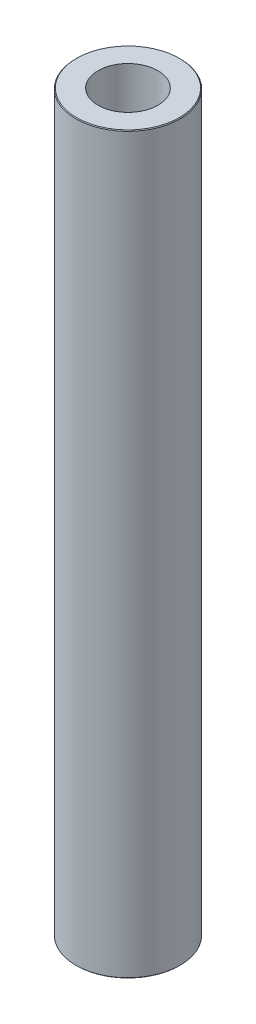
ISO-10303-21;
HEADER;
FILE_DESCRIPTION(('STEP AP214'),'2;1');
FILE_NAME('part.step','',(''),(''),'','','');
FILE_SCHEMA(('AUTOMOTIVE_DESIGN { 1 0 10303 214 1 1 1 1 }'));
ENDSEC;
DATA;
#1=APPLICATION_CONTEXT('core data for automotive mechanical design processes');
#2=APPLICATION_PROTOCOL_DEFINITION('international standard','automotive_design',2000,#1);
#3=PRODUCT_CONTEXT('',#1,'mechanical');
#4=PRODUCT('Part','Part','',(#3));
#5=PRODUCT_RELATED_PRODUCT_CATEGORY('part','',(#4));
#6=PRODUCT_DEFINITION_FORMATION('','',#4);
#7=PRODUCT_DEFINITION_CONTEXT('part definition',#1,'design');
#8=PRODUCT_DEFINITION('design','',#6,#7);
#9=PRODUCT_DEFINITION_SHAPE('','',#8);
#10=(LENGTH_UNIT() NAMED_UNIT(*) SI_UNIT(.MILLI.,.METRE.));
#11=(NAMED_UNIT(*) PLANE_ANGLE_UNIT() SI_UNIT($,.RADIAN.));
#12=(NAMED_UNIT(*) SI_UNIT($,.STERADIAN.) SOLID_ANGLE_UNIT());
#13=UNCERTAINTY_MEASURE_WITH_UNIT(LENGTH_MEASURE(1.E-05),#10,'distance_accuracy_value','');
#14=(GEOMETRIC_REPRESENTATION_CONTEXT(3) GLOBAL_UNCERTAINTY_ASSIGNED_CONTEXT((#13)) GLOBAL_UNIT_ASSIGNED_CONTEXT((#10,
#11,#12)) REPRESENTATION_CONTEXT('',''));
#15=CARTESIAN_POINT('',(0.,0.,0.));
#16=DIRECTION('',(0.,0.,1.));
#17=DIRECTION('',(1.,0.,0.));
#18=AXIS2_PLACEMENT_3D('',#15,#16,#17);
#19=CARTESIAN_POINT('',(0.,493.163189731923,0.));
#20=DIRECTION('',(0.,-1.,0.));
#21=DIRECTION('',(0.,0.,-1.));
#22=AXIS2_PLACEMENT_3D('',#19,#20,#21);
#23=CYLINDRICAL_SURFACE('',#22,35.);
#24=CARTESIAN_POINT('',(0.,492.677276126672,0.));
#25=DIRECTION('',(0.,1.,0.));
#26=DIRECTION('',(0.,0.,1.));
#27=AXIS2_PLACEMENT_3D('',#24,#25,#26);
#28=CIRCLE('',#27,35.);
#29=CARTESIAN_POINT('',(0.,492.677276126672,35.));
#30=VERTEX_POINT('',#29);
#31=EDGE_CURVE('E50',#30,#30,#28,.F.);
#32=ORIENTED_EDGE('',*,*,#31,.T.);
#33=EDGE_LOOP('',(#32));
#34=FACE_BOUND('',#33,.T.);
#35=CARTESIAN_POINT('',(0.,0.485913605251298,0.));
#36=DIRECTION('',(0.,1.,0.));
#37=DIRECTION('',(0.,0.,1.));
#38=AXIS2_PLACEMENT_3D('',#35,#36,#37);
#39=CIRCLE('',#38,35.);
#40=CARTESIAN_POINT('',(0.,0.485913605251298,35.));
#41=VERTEX_POINT('',#40);
#42=EDGE_CURVE('E51',#41,#41,#39,.T.);
#43=ORIENTED_EDGE('',*,*,#42,.T.);
#44=EDGE_LOOP('',(#43));
#45=FACE_BOUND('',#44,.T.);
#46=ADVANCED_FACE('F39',(#34,#45),#23,.T.);
#47=CARTESIAN_POINT('',(0.,493.163189731923,0.));
#48=DIRECTION('',(0.,1.,0.));
#49=DIRECTION('',(0.,0.,1.));
#50=AXIS2_PLACEMENT_3D('',#47,#48,#49);
#51=PLANE('',#50);
#52=CARTESIAN_POINT('',(0.,493.163189731923,0.));
#53=DIRECTION('',(0.,1.,0.));
#54=DIRECTION('',(0.,0.,1.));
#55=AXIS2_PLACEMENT_3D('',#52,#53,#54);
#56=CIRCLE('',#55,34.5140863947485);
#57=CARTESIAN_POINT('',(0.,493.163189731923,34.5140863947485));
#58=VERTEX_POINT('',#57);
#59=EDGE_CURVE('E54',#58,#58,#56,.T.);
#60=ORIENTED_EDGE('',*,*,#59,.T.);
#61=EDGE_LOOP('',(#60));
#62=FACE_BOUND('',#61,.T.);
#63=CARTESIAN_POINT('',(0.,493.163189731923,0.));
#64=DIRECTION('',(0.,1.,0.));
#65=DIRECTION('',(0.,0.,1.));
#66=AXIS2_PLACEMENT_3D('',#63,#64,#65);
#67=CIRCLE('',#66,20.119308325277);
#68=CARTESIAN_POINT('',(0.,493.163189731923,20.119308325277));
#69=VERTEX_POINT('',#68);
#70=EDGE_CURVE('E58',#69,#69,#67,.T.);
#71=ORIENTED_EDGE('',*,*,#70,.F.);
#72=EDGE_LOOP('',(#71));
#73=FACE_BOUND('',#72,.T.);
#74=ADVANCED_FACE('F69',(#62,#73),#51,.T.);
#75=CARTESIAN_POINT('',(0.,0.,0.));
#76=DIRECTION('',(0.,1.,0.));
#77=DIRECTION('',(0.,0.,1.));
#78=AXIS2_PLACEMENT_3D('',#75,#76,#77);
#79=PLANE('',#78);
#80=CARTESIAN_POINT('',(0.,0.,0.));
#81=DIRECTION('',(0.,1.,0.));
#82=DIRECTION('',(0.,0.,1.));
#83=AXIS2_PLACEMENT_3D('',#80,#81,#82);
#84=CIRCLE('',#83,34.5140863947487);
#85=CARTESIAN_POINT('',(0.,0.,34.5140863947487));
#86=VERTEX_POINT('',#85);
#87=EDGE_CURVE('E10',#86,#86,#84,.F.);
#88=ORIENTED_EDGE('',*,*,#87,.T.);
#89=EDGE_LOOP('',(#88));
#90=FACE_BOUND('',#89,.T.);
#91=CARTESIAN_POINT('',(0.,0.,0.));
#92=DIRECTION('',(0.,1.,0.));
#93=DIRECTION('',(0.,0.,1.));
#94=AXIS2_PLACEMENT_3D('',#91,#92,#93);
#95=CIRCLE('',#94,20.119308325277);
#96=CARTESIAN_POINT('',(0.,0.,20.119308325277));
#97=VERTEX_POINT('',#96);
#98=EDGE_CURVE('E63',#97,#97,#95,.T.);
#99=ORIENTED_EDGE('',*,*,#98,.T.);
#100=EDGE_LOOP('',(#99));
#101=FACE_BOUND('',#100,.T.);
#102=ADVANCED_FACE('F75',(#90,#101),#79,.F.);
#103=CARTESIAN_POINT('',(0.,493.163189731923,0.));
#104=DIRECTION('',(0.,-1.,0.));
#105=DIRECTION('',(0.,0.,-1.));
#106=AXIS2_PLACEMENT_3D('',#103,#104,#105);
#107=CYLINDRICAL_SURFACE('',#106,20.119308325277);
#108=ORIENTED_EDGE('',*,*,#70,.T.);
#109=EDGE_LOOP('',(#108));
#110=FACE_BOUND('',#109,.T.);
#111=ORIENTED_EDGE('',*,*,#98,.F.);
#112=EDGE_LOOP('',(#111));
#113=FACE_BOUND('',#112,.T.);
#114=ADVANCED_FACE('F70',(#110,#113),#107,.F.);
#115=CARTESIAN_POINT('',(0.,493.163189731923,0.));
#116=DIRECTION('',(0.,-1.,0.));
#117=DIRECTION('',(0.,0.,-1.));
#118=AXIS2_PLACEMENT_3D('',#115,#116,#117);
#119=CONICAL_SURFACE('',#118,34.5140863947485,0.785398163397427);
#120=ORIENTED_EDGE('',*,*,#31,.F.);
#121=EDGE_LOOP('',(#120));
#122=FACE_BOUND('',#121,.T.);
#123=ORIENTED_EDGE('',*,*,#59,.F.);
#124=EDGE_LOOP('',(#123));
#125=FACE_BOUND('',#124,.T.);
#126=ADVANCED_FACE('F81',(#122,#125),#119,.T.);
#127=CARTESIAN_POINT('',(0.,0.485913605251298,0.));
#128=DIRECTION('',(0.,1.,0.));
#129=DIRECTION('',(0.,0.,1.));
#130=AXIS2_PLACEMENT_3D('',#127,#128,#129);
#131=CONICAL_SURFACE('',#130,35.,0.785398163397427);
#132=ORIENTED_EDGE('',*,*,#87,.F.);
#133=EDGE_LOOP('',(#132));
#134=FACE_BOUND('',#133,.T.);
#135=ORIENTED_EDGE('',*,*,#42,.F.);
#136=EDGE_LOOP('',(#135));
#137=FACE_BOUND('',#136,.T.);
#138=ADVANCED_FACE('F45',(#134,#137),#131,.T.);
#139=CLOSED_SHELL('',(#46,#74,#102,#114,#126,#138));
#140=MANIFOLD_SOLID_BREP('B2',#139);
#141=ADVANCED_BREP_SHAPE_REPRESENTATION('',(#18,#140),#14);
#142=SHAPE_DEFINITION_REPRESENTATION(#9,#141);
ENDSEC;
END-ISO-10303-21;
